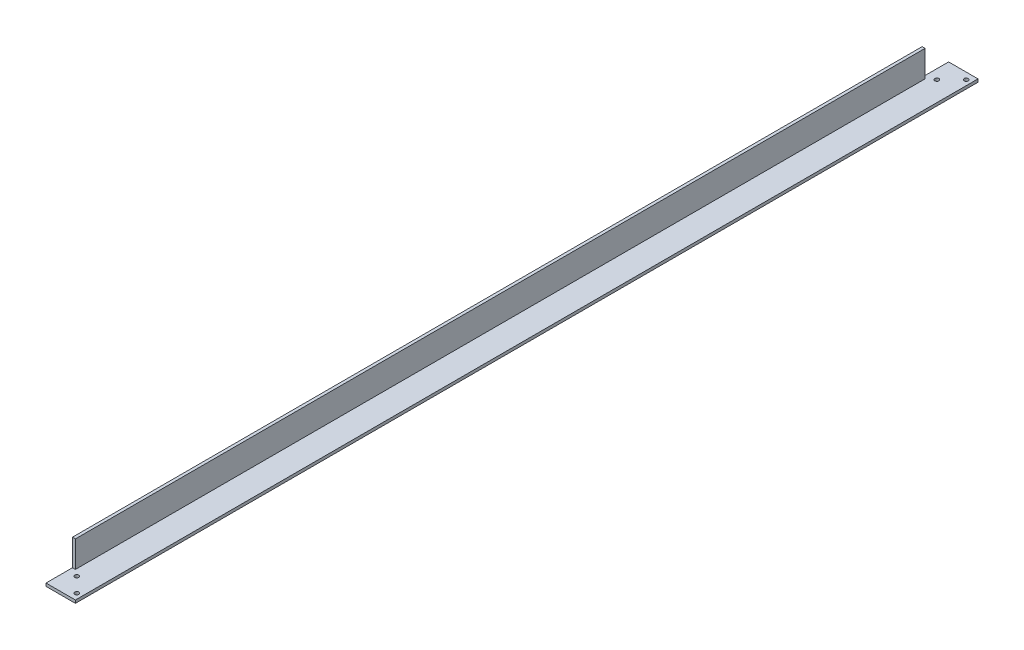
ISO-10303-21;
HEADER;
FILE_DESCRIPTION(('STEP AP214'),'2;1');
FILE_NAME('part.step','',(''),(''),'','','');
FILE_SCHEMA(('AUTOMOTIVE_DESIGN { 1 0 10303 214 1 1 1 1 }'));
ENDSEC;
DATA;
#1=APPLICATION_CONTEXT('core data for automotive mechanical design processes');
#2=APPLICATION_PROTOCOL_DEFINITION('international standard','automotive_design',2000,#1);
#3=PRODUCT_CONTEXT('',#1,'mechanical');
#4=PRODUCT('Part','Part','',(#3));
#5=PRODUCT_RELATED_PRODUCT_CATEGORY('part','',(#4));
#6=PRODUCT_DEFINITION_FORMATION('','',#4);
#7=PRODUCT_DEFINITION_CONTEXT('part definition',#1,'design');
#8=PRODUCT_DEFINITION('design','',#6,#7);
#9=PRODUCT_DEFINITION_SHAPE('','',#8);
#10=(LENGTH_UNIT() NAMED_UNIT(*) SI_UNIT(.MILLI.,.METRE.));
#11=(NAMED_UNIT(*) PLANE_ANGLE_UNIT() SI_UNIT($,.RADIAN.));
#12=(NAMED_UNIT(*) SI_UNIT($,.STERADIAN.) SOLID_ANGLE_UNIT());
#13=UNCERTAINTY_MEASURE_WITH_UNIT(LENGTH_MEASURE(1.E-05),#10,'distance_accuracy_value','');
#14=(GEOMETRIC_REPRESENTATION_CONTEXT(3) GLOBAL_UNCERTAINTY_ASSIGNED_CONTEXT((#13)) GLOBAL_UNIT_ASSIGNED_CONTEXT((#10,
#11,#12)) REPRESENTATION_CONTEXT('',''));
#15=CARTESIAN_POINT('',(0.,0.,0.));
#16=DIRECTION('',(0.,0.,1.));
#17=DIRECTION('',(1.,0.,0.));
#18=AXIS2_PLACEMENT_3D('',#15,#16,#17);
#19=CARTESIAN_POINT('',(0.,20.,614.));
#20=DIRECTION('',(1.,0.,0.));
#21=DIRECTION('',(0.,0.,-1.));
#22=AXIS2_PLACEMENT_3D('',#19,#20,#21);
#23=PLANE('',#22);
#24=DIRECTION('',(0.,0.,-1.));
#25=VECTOR('',#24,1.);
#26=CARTESIAN_POINT('',(0.,2.,614.));
#27=LINE('',#26,#25);
#28=CARTESIAN_POINT('',(0.,2.,614.));
#29=VERTEX_POINT('',#28);
#30=CARTESIAN_POINT('',(0.,2.,596.));
#31=VERTEX_POINT('',#30);
#32=EDGE_CURVE('E113',#29,#31,#27,.T.);
#33=ORIENTED_EDGE('',*,*,#32,.T.);
#34=DIRECTION('',(0.,1.,0.));
#35=VECTOR('',#34,1.);
#36=CARTESIAN_POINT('',(0.,20.,596.));
#37=LINE('',#36,#35);
#38=CARTESIAN_POINT('',(0.,20.,596.));
#39=VERTEX_POINT('',#38);
#40=EDGE_CURVE('E119',#31,#39,#37,.T.);
#41=ORIENTED_EDGE('',*,*,#40,.T.);
#42=DIRECTION('',(0.,0.,-1.));
#43=VECTOR('',#42,1.);
#44=CARTESIAN_POINT('',(0.,20.,614.));
#45=LINE('',#44,#43);
#46=CARTESIAN_POINT('',(0.,20.,18.));
#47=VERTEX_POINT('',#46);
#48=EDGE_CURVE('E158',#39,#47,#45,.T.);
#49=ORIENTED_EDGE('',*,*,#48,.T.);
#50=DIRECTION('',(0.,-1.,0.));
#51=VECTOR('',#50,1.);
#52=CARTESIAN_POINT('',(0.,20.,18.));
#53=LINE('',#52,#51);
#54=CARTESIAN_POINT('',(0.,2.,18.));
#55=VERTEX_POINT('',#54);
#56=EDGE_CURVE('E139',#47,#55,#53,.T.);
#57=ORIENTED_EDGE('',*,*,#56,.T.);
#58=DIRECTION('',(0.,0.,-1.));
#59=VECTOR('',#58,1.);
#60=CARTESIAN_POINT('',(0.,2.,0.));
#61=LINE('',#60,#59);
#62=CARTESIAN_POINT('',(0.,2.,0.));
#63=VERTEX_POINT('',#62);
#64=EDGE_CURVE('E142',#55,#63,#61,.T.);
#65=ORIENTED_EDGE('',*,*,#64,.T.);
#66=DIRECTION('',(0.,-1.,0.));
#67=VECTOR('',#66,1.);
#68=CARTESIAN_POINT('',(0.,20.,0.));
#69=LINE('',#68,#67);
#70=CARTESIAN_POINT('',(0.,0.,0.));
#71=VERTEX_POINT('',#70);
#72=EDGE_CURVE('E137',#63,#71,#69,.T.);
#73=ORIENTED_EDGE('',*,*,#72,.T.);
#74=DIRECTION('',(0.,0.,-1.));
#75=VECTOR('',#74,1.);
#76=CARTESIAN_POINT('',(0.,0.,614.));
#77=LINE('',#76,#75);
#78=CARTESIAN_POINT('',(0.,0.,614.));
#79=VERTEX_POINT('',#78);
#80=EDGE_CURVE('E11',#79,#71,#77,.T.);
#81=ORIENTED_EDGE('',*,*,#80,.F.);
#82=DIRECTION('',(0.,-1.,0.));
#83=VECTOR('',#82,1.);
#84=CARTESIAN_POINT('',(0.,20.,614.));
#85=LINE('',#84,#83);
#86=EDGE_CURVE('E79',#29,#79,#85,.T.);
#87=ORIENTED_EDGE('',*,*,#86,.F.);
#88=EDGE_LOOP('',(#33,#41,#49,#57,#65,#73,#81,#87));
#89=FACE_BOUND('',#88,.T.);
#90=ADVANCED_FACE('F39',(#89),#23,.F.);
#91=CARTESIAN_POINT('',(0.,0.,614.));
#92=DIRECTION('',(0.,1.,0.));
#93=DIRECTION('',(0.,0.,1.));
#94=AXIS2_PLACEMENT_3D('',#91,#92,#93);
#95=PLANE('',#94);
#96=CARTESIAN_POINT('',(16.48,0.,4.48000000000001));
#97=DIRECTION('',(0.,1.,0.));
#98=DIRECTION('',(1.,0.,0.));
#99=AXIS2_PLACEMENT_3D('',#96,#97,#98);
#100=CIRCLE('',#99,1.4);
#101=CARTESIAN_POINT('',(17.88,0.,4.48000000000001));
#102=VERTEX_POINT('',#101);
#103=EDGE_CURVE('E212',#102,#102,#100,.T.);
#104=ORIENTED_EDGE('',*,*,#103,.T.);
#105=EDGE_LOOP('',(#104));
#106=FACE_BOUND('',#105,.T.);
#107=CARTESIAN_POINT('',(16.48,0.,609.52));
#108=DIRECTION('',(0.,1.,0.));
#109=DIRECTION('',(-1.,0.,0.));
#110=AXIS2_PLACEMENT_3D('',#107,#108,#109);
#111=CIRCLE('',#110,1.39999999999998);
#112=CARTESIAN_POINT('',(15.08,0.,609.52));
#113=VERTEX_POINT('',#112);
#114=EDGE_CURVE('E216',#113,#113,#111,.T.);
#115=ORIENTED_EDGE('',*,*,#114,.T.);
#116=EDGE_LOOP('',(#115));
#117=FACE_BOUND('',#116,.T.);
#118=CARTESIAN_POINT('',(6.48,0.,14.48));
#119=DIRECTION('',(0.,1.,0.));
#120=DIRECTION('',(1.,0.,0.));
#121=AXIS2_PLACEMENT_3D('',#118,#119,#120);
#122=CIRCLE('',#121,1.4);
#123=CARTESIAN_POINT('',(7.88,0.,14.48));
#124=VERTEX_POINT('',#123);
#125=EDGE_CURVE('E220',#124,#124,#122,.T.);
#126=ORIENTED_EDGE('',*,*,#125,.T.);
#127=EDGE_LOOP('',(#126));
#128=FACE_BOUND('',#127,.T.);
#129=CARTESIAN_POINT('',(6.48,0.,599.52));
#130=DIRECTION('',(0.,1.,0.));
#131=DIRECTION('',(-1.,0.,0.));
#132=AXIS2_PLACEMENT_3D('',#129,#130,#131);
#133=CIRCLE('',#132,1.39999999999997);
#134=CARTESIAN_POINT('',(5.08000000000003,0.,599.52));
#135=VERTEX_POINT('',#134);
#136=EDGE_CURVE('E149',#135,#135,#133,.T.);
#137=ORIENTED_EDGE('',*,*,#136,.T.);
#138=EDGE_LOOP('',(#137));
#139=FACE_BOUND('',#138,.T.);
#140=DIRECTION('',(1.,0.,0.));
#141=VECTOR('',#140,1.);
#142=CARTESIAN_POINT('',(0.,0.,0.));
#143=LINE('',#142,#141);
#144=CARTESIAN_POINT('',(20.,0.,0.));
#145=VERTEX_POINT('',#144);
#146=EDGE_CURVE('E160',#71,#145,#143,.T.);
#147=ORIENTED_EDGE('',*,*,#146,.T.);
#148=DIRECTION('',(0.,0.,-1.));
#149=VECTOR('',#148,1.);
#150=CARTESIAN_POINT('',(20.,0.,614.));
#151=LINE('',#150,#149);
#152=CARTESIAN_POINT('',(20.,0.,614.));
#153=VERTEX_POINT('',#152);
#154=EDGE_CURVE('E46',#153,#145,#151,.T.);
#155=ORIENTED_EDGE('',*,*,#154,.F.);
#156=DIRECTION('',(1.,0.,0.));
#157=VECTOR('',#156,1.);
#158=CARTESIAN_POINT('',(0.,0.,614.));
#159=LINE('',#158,#157);
#160=EDGE_CURVE('E153',#79,#153,#159,.T.);
#161=ORIENTED_EDGE('',*,*,#160,.F.);
#162=ORIENTED_EDGE('',*,*,#80,.T.);
#163=EDGE_LOOP('',(#147,#155,#161,#162));
#164=FACE_BOUND('',#163,.T.);
#165=ADVANCED_FACE('F199',(#106,#117,#128,#139,#164),#95,.F.);
#166=CARTESIAN_POINT('',(20.,0.,614.));
#167=DIRECTION('',(-1.,0.,0.));
#168=DIRECTION('',(0.,0.,1.));
#169=AXIS2_PLACEMENT_3D('',#166,#167,#168);
#170=PLANE('',#169);
#171=DIRECTION('',(0.,1.,0.));
#172=VECTOR('',#171,1.);
#173=CARTESIAN_POINT('',(20.,0.,0.));
#174=LINE('',#173,#172);
#175=CARTESIAN_POINT('',(20.,2.,0.));
#176=VERTEX_POINT('',#175);
#177=EDGE_CURVE('E76',#145,#176,#174,.T.);
#178=ORIENTED_EDGE('',*,*,#177,.T.);
#179=DIRECTION('',(0.,0.,-1.));
#180=VECTOR('',#179,1.);
#181=CARTESIAN_POINT('',(20.,2.,614.));
#182=LINE('',#181,#180);
#183=CARTESIAN_POINT('',(20.,2.,614.));
#184=VERTEX_POINT('',#183);
#185=EDGE_CURVE('E169',#184,#176,#182,.T.);
#186=ORIENTED_EDGE('',*,*,#185,.F.);
#187=DIRECTION('',(0.,1.,0.));
#188=VECTOR('',#187,1.);
#189=CARTESIAN_POINT('',(20.,0.,614.));
#190=LINE('',#189,#188);
#191=EDGE_CURVE('E59',#153,#184,#190,.T.);
#192=ORIENTED_EDGE('',*,*,#191,.F.);
#193=ORIENTED_EDGE('',*,*,#154,.T.);
#194=EDGE_LOOP('',(#178,#186,#192,#193));
#195=FACE_BOUND('',#194,.T.);
#196=ADVANCED_FACE('F171',(#195),#170,.F.);
#197=CARTESIAN_POINT('',(20.,2.,614.));
#198=DIRECTION('',(0.,-1.,0.));
#199=DIRECTION('',(1.,0.,0.));
#200=AXIS2_PLACEMENT_3D('',#197,#198,#199);
#201=PLANE('',#200);
#202=CARTESIAN_POINT('',(16.48,2.,4.48000000000001));
#203=DIRECTION('',(0.,1.,0.));
#204=DIRECTION('',(1.,0.,0.));
#205=AXIS2_PLACEMENT_3D('',#202,#203,#204);
#206=CIRCLE('',#205,1.4);
#207=CARTESIAN_POINT('',(17.88,2.,4.48000000000001));
#208=VERTEX_POINT('',#207);
#209=EDGE_CURVE('E263',#208,#208,#206,.T.);
#210=ORIENTED_EDGE('',*,*,#209,.F.);
#211=EDGE_LOOP('',(#210));
#212=FACE_BOUND('',#211,.T.);
#213=CARTESIAN_POINT('',(16.48,2.,609.52));
#214=DIRECTION('',(0.,1.,0.));
#215=DIRECTION('',(-1.,0.,0.));
#216=AXIS2_PLACEMENT_3D('',#213,#214,#215);
#217=CIRCLE('',#216,1.39999999999998);
#218=CARTESIAN_POINT('',(15.08,2.,609.52));
#219=VERTEX_POINT('',#218);
#220=EDGE_CURVE('E257',#219,#219,#217,.T.);
#221=ORIENTED_EDGE('',*,*,#220,.F.);
#222=EDGE_LOOP('',(#221));
#223=FACE_BOUND('',#222,.T.);
#224=CARTESIAN_POINT('',(6.48,2.,14.48));
#225=DIRECTION('',(0.,1.,0.));
#226=DIRECTION('',(1.,0.,0.));
#227=AXIS2_PLACEMENT_3D('',#224,#225,#226);
#228=CIRCLE('',#227,1.4);
#229=CARTESIAN_POINT('',(7.88,2.,14.48));
#230=VERTEX_POINT('',#229);
#231=EDGE_CURVE('E253',#230,#230,#228,.T.);
#232=ORIENTED_EDGE('',*,*,#231,.F.);
#233=EDGE_LOOP('',(#232));
#234=FACE_BOUND('',#233,.T.);
#235=CARTESIAN_POINT('',(6.48,2.,599.52));
#236=DIRECTION('',(0.,1.,0.));
#237=DIRECTION('',(-1.,0.,0.));
#238=AXIS2_PLACEMENT_3D('',#235,#236,#237);
#239=CIRCLE('',#238,1.39999999999997);
#240=CARTESIAN_POINT('',(5.08000000000003,2.,599.52));
#241=VERTEX_POINT('',#240);
#242=EDGE_CURVE('E134',#241,#241,#239,.T.);
#243=ORIENTED_EDGE('',*,*,#242,.F.);
#244=EDGE_LOOP('',(#243));
#245=FACE_BOUND('',#244,.T.);
#246=DIRECTION('',(-1.,0.,0.));
#247=VECTOR('',#246,1.);
#248=CARTESIAN_POINT('',(20.,2.,0.));
#249=LINE('',#248,#247);
#250=EDGE_CURVE('E154',#176,#63,#249,.T.);
#251=ORIENTED_EDGE('',*,*,#250,.T.);
#252=ORIENTED_EDGE('',*,*,#64,.F.);
#253=DIRECTION('',(1.,0.,0.));
#254=VECTOR('',#253,1.);
#255=CARTESIAN_POINT('',(0.,2.,18.));
#256=LINE('',#255,#254);
#257=CARTESIAN_POINT('',(2.,2.,18.));
#258=VERTEX_POINT('',#257);
#259=EDGE_CURVE('E131',#55,#258,#256,.T.);
#260=ORIENTED_EDGE('',*,*,#259,.T.);
#261=DIRECTION('',(0.,0.,-1.));
#262=VECTOR('',#261,1.);
#263=CARTESIAN_POINT('',(2.,2.,614.));
#264=LINE('',#263,#262);
#265=CARTESIAN_POINT('',(2.,2.,596.));
#266=VERTEX_POINT('',#265);
#267=EDGE_CURVE('E115',#266,#258,#264,.T.);
#268=ORIENTED_EDGE('',*,*,#267,.F.);
#269=DIRECTION('',(1.,0.,0.));
#270=VECTOR('',#269,1.);
#271=CARTESIAN_POINT('',(0.,2.,596.));
#272=LINE('',#271,#270);
#273=EDGE_CURVE('E109',#31,#266,#272,.T.);
#274=ORIENTED_EDGE('',*,*,#273,.F.);
#275=ORIENTED_EDGE('',*,*,#32,.F.);
#276=DIRECTION('',(-1.,0.,0.));
#277=VECTOR('',#276,1.);
#278=CARTESIAN_POINT('',(20.,2.,614.));
#279=LINE('',#278,#277);
#280=EDGE_CURVE('E53',#184,#29,#279,.T.);
#281=ORIENTED_EDGE('',*,*,#280,.F.);
#282=ORIENTED_EDGE('',*,*,#185,.T.);
#283=EDGE_LOOP('',(#251,#252,#260,#268,#274,#275,#281,#282));
#284=FACE_BOUND('',#283,.T.);
#285=ADVANCED_FACE('F111',(#212,#223,#234,#245,#284),#201,.F.);
#286=CARTESIAN_POINT('',(2.,2.,614.));
#287=DIRECTION('',(-1.,0.,0.));
#288=DIRECTION('',(0.,0.,1.));
#289=AXIS2_PLACEMENT_3D('',#286,#287,#288);
#290=PLANE('',#289);
#291=DIRECTION('',(0.,0.,-1.));
#292=VECTOR('',#291,1.);
#293=CARTESIAN_POINT('',(2.,20.,614.));
#294=LINE('',#293,#292);
#295=CARTESIAN_POINT('',(2.,20.,596.));
#296=VERTEX_POINT('',#295);
#297=CARTESIAN_POINT('',(2.,20.,18.));
#298=VERTEX_POINT('',#297);
#299=EDGE_CURVE('E165',#296,#298,#294,.T.);
#300=ORIENTED_EDGE('',*,*,#299,.F.);
#301=DIRECTION('',(0.,1.,0.));
#302=VECTOR('',#301,1.);
#303=CARTESIAN_POINT('',(2.,20.,596.));
#304=LINE('',#303,#302);
#305=EDGE_CURVE('E129',#266,#296,#304,.T.);
#306=ORIENTED_EDGE('',*,*,#305,.F.);
#307=ORIENTED_EDGE('',*,*,#267,.T.);
#308=DIRECTION('',(0.,-1.,0.));
#309=VECTOR('',#308,1.);
#310=CARTESIAN_POINT('',(2.,20.,18.));
#311=LINE('',#310,#309);
#312=EDGE_CURVE('E143',#298,#258,#311,.T.);
#313=ORIENTED_EDGE('',*,*,#312,.F.);
#314=EDGE_LOOP('',(#300,#306,#307,#313));
#315=FACE_BOUND('',#314,.T.);
#316=ADVANCED_FACE('F187',(#315),#290,.F.);
#317=CARTESIAN_POINT('',(2.,20.,614.));
#318=DIRECTION('',(0.,-1.,0.));
#319=DIRECTION('',(0.,0.,-1.));
#320=AXIS2_PLACEMENT_3D('',#317,#318,#319);
#321=PLANE('',#320);
#322=ORIENTED_EDGE('',*,*,#48,.F.);
#323=DIRECTION('',(1.,0.,0.));
#324=VECTOR('',#323,1.);
#325=CARTESIAN_POINT('',(0.,20.,596.));
#326=LINE('',#325,#324);
#327=EDGE_CURVE('E118',#39,#296,#326,.T.);
#328=ORIENTED_EDGE('',*,*,#327,.T.);
#329=ORIENTED_EDGE('',*,*,#299,.T.);
#330=DIRECTION('',(1.,0.,0.));
#331=VECTOR('',#330,1.);
#332=CARTESIAN_POINT('',(0.,20.,18.));
#333=LINE('',#332,#331);
#334=EDGE_CURVE('E146',#47,#298,#333,.T.);
#335=ORIENTED_EDGE('',*,*,#334,.F.);
#336=EDGE_LOOP('',(#322,#328,#329,#335));
#337=FACE_BOUND('',#336,.T.);
#338=ADVANCED_FACE('F184',(#337),#321,.F.);
#339=CARTESIAN_POINT('',(0.,0.,614.));
#340=DIRECTION('',(0.,0.,1.));
#341=DIRECTION('',(1.,0.,0.));
#342=AXIS2_PLACEMENT_3D('',#339,#340,#341);
#343=PLANE('',#342);
#344=ORIENTED_EDGE('',*,*,#280,.T.);
#345=ORIENTED_EDGE('',*,*,#86,.T.);
#346=ORIENTED_EDGE('',*,*,#160,.T.);
#347=ORIENTED_EDGE('',*,*,#191,.T.);
#348=EDGE_LOOP('',(#344,#345,#346,#347));
#349=FACE_BOUND('',#348,.T.);
#350=ADVANCED_FACE('F194',(#349),#343,.T.);
#351=CARTESIAN_POINT('',(0.,0.,0.));
#352=DIRECTION('',(0.,0.,1.));
#353=DIRECTION('',(1.,0.,0.));
#354=AXIS2_PLACEMENT_3D('',#351,#352,#353);
#355=PLANE('',#354);
#356=ORIENTED_EDGE('',*,*,#72,.F.);
#357=ORIENTED_EDGE('',*,*,#250,.F.);
#358=ORIENTED_EDGE('',*,*,#177,.F.);
#359=ORIENTED_EDGE('',*,*,#146,.F.);
#360=EDGE_LOOP('',(#356,#357,#358,#359));
#361=FACE_BOUND('',#360,.T.);
#362=ADVANCED_FACE('F177',(#361),#355,.F.);
#363=CARTESIAN_POINT('',(0.,20.,18.));
#364=DIRECTION('',(0.,0.,1.));
#365=DIRECTION('',(1.,0.,0.));
#366=AXIS2_PLACEMENT_3D('',#363,#364,#365);
#367=PLANE('',#366);
#368=ORIENTED_EDGE('',*,*,#312,.T.);
#369=ORIENTED_EDGE('',*,*,#259,.F.);
#370=ORIENTED_EDGE('',*,*,#56,.F.);
#371=ORIENTED_EDGE('',*,*,#334,.T.);
#372=EDGE_LOOP('',(#368,#369,#370,#371));
#373=FACE_BOUND('',#372,.T.);
#374=ADVANCED_FACE('F181',(#373),#367,.F.);
#375=CARTESIAN_POINT('',(0.,20.,596.));
#376=DIRECTION('',(0.,0.,-1.));
#377=DIRECTION('',(-1.,0.,0.));
#378=AXIS2_PLACEMENT_3D('',#375,#376,#377);
#379=PLANE('',#378);
#380=ORIENTED_EDGE('',*,*,#305,.T.);
#381=ORIENTED_EDGE('',*,*,#327,.F.);
#382=ORIENTED_EDGE('',*,*,#40,.F.);
#383=ORIENTED_EDGE('',*,*,#273,.T.);
#384=EDGE_LOOP('',(#380,#381,#382,#383));
#385=FACE_BOUND('',#384,.T.);
#386=ADVANCED_FACE('F122',(#385),#379,.F.);
#387=CARTESIAN_POINT('',(6.48,0.,599.52));
#388=DIRECTION('',(0.,1.,0.));
#389=DIRECTION('',(-1.,0.,0.));
#390=AXIS2_PLACEMENT_3D('',#387,#388,#389);
#391=CYLINDRICAL_SURFACE('',#390,1.39999999999997);
#392=ORIENTED_EDGE('',*,*,#136,.F.);
#393=EDGE_LOOP('',(#392));
#394=FACE_BOUND('',#393,.T.);
#395=ORIENTED_EDGE('',*,*,#242,.T.);
#396=EDGE_LOOP('',(#395));
#397=FACE_BOUND('',#396,.T.);
#398=ADVANCED_FACE('F233',(#394,#397),#391,.F.);
#399=CARTESIAN_POINT('',(6.48,0.,14.48));
#400=DIRECTION('',(0.,1.,0.));
#401=DIRECTION('',(-1.,0.,0.));
#402=AXIS2_PLACEMENT_3D('',#399,#400,#401);
#403=CYLINDRICAL_SURFACE('',#402,1.4);
#404=ORIENTED_EDGE('',*,*,#125,.F.);
#405=EDGE_LOOP('',(#404));
#406=FACE_BOUND('',#405,.T.);
#407=ORIENTED_EDGE('',*,*,#231,.T.);
#408=EDGE_LOOP('',(#407));
#409=FACE_BOUND('',#408,.T.);
#410=ADVANCED_FACE('F236',(#406,#409),#403,.F.);
#411=CARTESIAN_POINT('',(16.48,0.,609.52));
#412=DIRECTION('',(0.,1.,0.));
#413=DIRECTION('',(-1.,0.,0.));
#414=AXIS2_PLACEMENT_3D('',#411,#412,#413);
#415=CYLINDRICAL_SURFACE('',#414,1.39999999999998);
#416=ORIENTED_EDGE('',*,*,#114,.F.);
#417=EDGE_LOOP('',(#416));
#418=FACE_BOUND('',#417,.T.);
#419=ORIENTED_EDGE('',*,*,#220,.T.);
#420=EDGE_LOOP('',(#419));
#421=FACE_BOUND('',#420,.T.);
#422=ADVANCED_FACE('F241',(#418,#421),#415,.F.);
#423=CARTESIAN_POINT('',(16.48,0.,4.48000000000001));
#424=DIRECTION('',(0.,1.,0.));
#425=DIRECTION('',(-1.,0.,0.));
#426=AXIS2_PLACEMENT_3D('',#423,#424,#425);
#427=CYLINDRICAL_SURFACE('',#426,1.4);
#428=ORIENTED_EDGE('',*,*,#103,.F.);
#429=EDGE_LOOP('',(#428));
#430=FACE_BOUND('',#429,.T.);
#431=ORIENTED_EDGE('',*,*,#209,.T.);
#432=EDGE_LOOP('',(#431));
#433=FACE_BOUND('',#432,.T.);
#434=ADVANCED_FACE('F238',(#430,#433),#427,.F.);
#435=CLOSED_SHELL('',(#90,#165,#196,#285,#316,#338,#350,#362,#374,#386,#398,#410,#422,#434));
#436=MANIFOLD_SOLID_BREP('B2',#435);
#437=ADVANCED_BREP_SHAPE_REPRESENTATION('',(#18,#436),#14);
#438=SHAPE_DEFINITION_REPRESENTATION(#9,#437);
ENDSEC;
END-ISO-10303-21;
